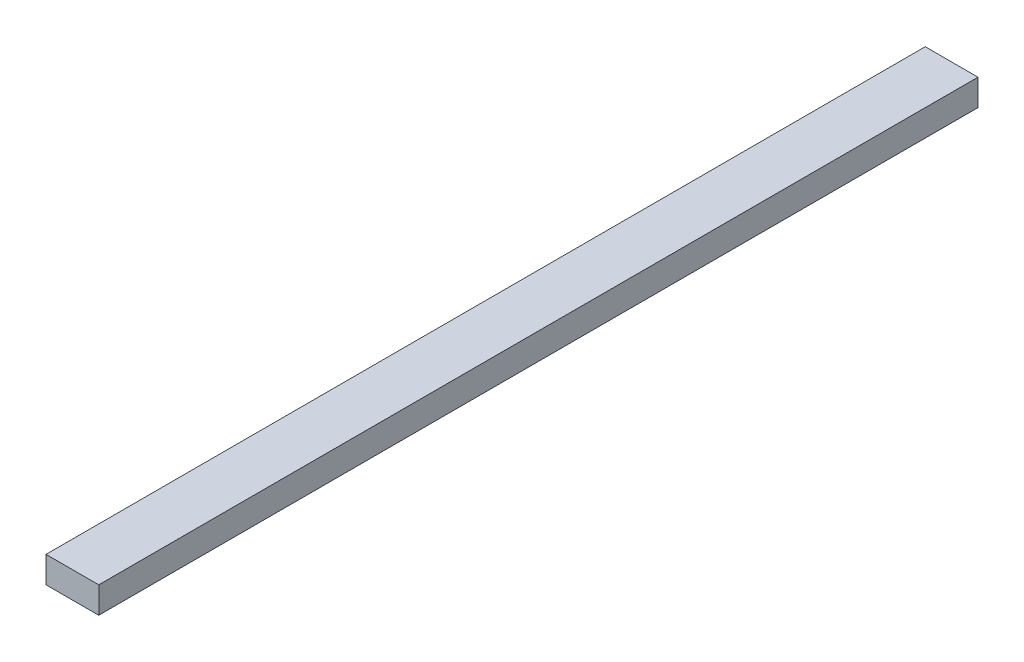
ISO-10303-21;
HEADER;
FILE_DESCRIPTION(('STEP AP214'),'2;1');
FILE_NAME('part.step','',(''),(''),'','','');
FILE_SCHEMA(('AUTOMOTIVE_DESIGN { 1 0 10303 214 1 1 1 1 }'));
ENDSEC;
DATA;
#1=APPLICATION_CONTEXT('core data for automotive mechanical design processes');
#2=APPLICATION_PROTOCOL_DEFINITION('international standard','automotive_design',2000,#1);
#3=PRODUCT_CONTEXT('',#1,'mechanical');
#4=PRODUCT('Part','Part','',(#3));
#5=PRODUCT_RELATED_PRODUCT_CATEGORY('part','',(#4));
#6=PRODUCT_DEFINITION_FORMATION('','',#4);
#7=PRODUCT_DEFINITION_CONTEXT('part definition',#1,'design');
#8=PRODUCT_DEFINITION('design','',#6,#7);
#9=PRODUCT_DEFINITION_SHAPE('','',#8);
#10=(LENGTH_UNIT() NAMED_UNIT(*) SI_UNIT(.MILLI.,.METRE.));
#11=(NAMED_UNIT(*) PLANE_ANGLE_UNIT() SI_UNIT($,.RADIAN.));
#12=(NAMED_UNIT(*) SI_UNIT($,.STERADIAN.) SOLID_ANGLE_UNIT());
#13=UNCERTAINTY_MEASURE_WITH_UNIT(LENGTH_MEASURE(1.E-05),#10,'distance_accuracy_value','');
#14=(GEOMETRIC_REPRESENTATION_CONTEXT(3) GLOBAL_UNCERTAINTY_ASSIGNED_CONTEXT((#13)) GLOBAL_UNIT_ASSIGNED_CONTEXT((#10,
#11,#12)) REPRESENTATION_CONTEXT('',''));
#15=CARTESIAN_POINT('',(0.,0.,0.));
#16=DIRECTION('',(0.,0.,1.));
#17=DIRECTION('',(1.,0.,0.));
#18=AXIS2_PLACEMENT_3D('',#15,#16,#17);
#19=CARTESIAN_POINT('',(-9.48424737456244,-4.64594099016502,500.));
#20=DIRECTION('',(1.,0.,0.));
#21=DIRECTION('',(0.,1.,0.));
#22=AXIS2_PLACEMENT_3D('',#19,#20,#21);
#23=PLANE('',#22);
#24=DIRECTION('',(0.,-1.,0.));
#25=VECTOR('',#24,1.);
#26=CARTESIAN_POINT('',(-9.48424737456244,-4.64594099016502,0.));
#27=LINE('',#26,#25);
#28=CARTESIAN_POINT('',(-9.48424737456244,-4.64594099016502,0.));
#29=VERTEX_POINT('',#28);
#30=CARTESIAN_POINT('',(-9.48424737456244,-19.645940990165,0.));
#31=VERTEX_POINT('',#30);
#32=EDGE_CURVE('E107',#29,#31,#27,.T.);
#33=ORIENTED_EDGE('',*,*,#32,.T.);
#34=DIRECTION('',(0.,0.,-1.));
#35=VECTOR('',#34,1.);
#36=CARTESIAN_POINT('',(-9.48424737456244,-19.645940990165,500.));
#37=LINE('',#36,#35);
#38=CARTESIAN_POINT('',(-9.48424737456244,-19.645940990165,500.));
#39=VERTEX_POINT('',#38);
#40=EDGE_CURVE('E11',#39,#31,#37,.T.);
#41=ORIENTED_EDGE('',*,*,#40,.F.);
#42=DIRECTION('',(0.,-1.,0.));
#43=VECTOR('',#42,1.);
#44=CARTESIAN_POINT('',(-9.48424737456244,-4.64594099016502,500.));
#45=LINE('',#44,#43);
#46=CARTESIAN_POINT('',(-9.48424737456244,-4.64594099016502,500.));
#47=VERTEX_POINT('',#46);
#48=EDGE_CURVE('E91',#47,#39,#45,.T.);
#49=ORIENTED_EDGE('',*,*,#48,.F.);
#50=DIRECTION('',(0.,0.,-1.));
#51=VECTOR('',#50,1.);
#52=CARTESIAN_POINT('',(-9.48424737456244,-4.64594099016502,500.));
#53=LINE('',#52,#51);
#54=EDGE_CURVE('E103',#47,#29,#53,.T.);
#55=ORIENTED_EDGE('',*,*,#54,.T.);
#56=EDGE_LOOP('',(#33,#41,#49,#55));
#57=FACE_BOUND('',#56,.T.);
#58=ADVANCED_FACE('F39',(#57),#23,.F.);
#59=CARTESIAN_POINT('',(-9.48424737456244,-19.645940990165,500.));
#60=DIRECTION('',(0.,1.,0.));
#61=DIRECTION('',(0.,0.,1.));
#62=AXIS2_PLACEMENT_3D('',#59,#60,#61);
#63=PLANE('',#62);
#64=DIRECTION('',(1.,0.,0.));
#65=VECTOR('',#64,1.);
#66=CARTESIAN_POINT('',(-9.48424737456244,-19.645940990165,0.));
#67=LINE('',#66,#65);
#68=CARTESIAN_POINT('',(20.5157526254376,-19.645940990165,0.));
#69=VERTEX_POINT('',#68);
#70=EDGE_CURVE('E96',#31,#69,#67,.T.);
#71=ORIENTED_EDGE('',*,*,#70,.T.);
#72=DIRECTION('',(0.,0.,-1.));
#73=VECTOR('',#72,1.);
#74=CARTESIAN_POINT('',(20.5157526254376,-19.645940990165,500.));
#75=LINE('',#74,#73);
#76=CARTESIAN_POINT('',(20.5157526254376,-19.645940990165,500.));
#77=VERTEX_POINT('',#76);
#78=EDGE_CURVE('E48',#77,#69,#75,.T.);
#79=ORIENTED_EDGE('',*,*,#78,.F.);
#80=DIRECTION('',(1.,0.,0.));
#81=VECTOR('',#80,1.);
#82=CARTESIAN_POINT('',(-9.48424737456244,-19.645940990165,500.));
#83=LINE('',#82,#81);
#84=EDGE_CURVE('E86',#39,#77,#83,.T.);
#85=ORIENTED_EDGE('',*,*,#84,.F.);
#86=ORIENTED_EDGE('',*,*,#40,.T.);
#87=EDGE_LOOP('',(#71,#79,#85,#86));
#88=FACE_BOUND('',#87,.T.);
#89=ADVANCED_FACE('F95',(#88),#63,.F.);
#90=CARTESIAN_POINT('',(20.5157526254376,-4.64594099016502,500.));
#91=DIRECTION('',(-1.,0.,0.));
#92=DIRECTION('',(0.,0.,1.));
#93=AXIS2_PLACEMENT_3D('',#90,#91,#92);
#94=PLANE('',#93);
#95=DIRECTION('',(0.,1.,0.));
#96=VECTOR('',#95,1.);
#97=CARTESIAN_POINT('',(20.5157526254376,-4.64594099016502,0.));
#98=LINE('',#97,#96);
#99=CARTESIAN_POINT('',(20.5157526254376,-4.64594099016502,0.));
#100=VERTEX_POINT('',#99);
#101=EDGE_CURVE('E73',#69,#100,#98,.T.);
#102=ORIENTED_EDGE('',*,*,#101,.T.);
#103=DIRECTION('',(0.,0.,-1.));
#104=VECTOR('',#103,1.);
#105=CARTESIAN_POINT('',(20.5157526254376,-4.64594099016502,500.));
#106=LINE('',#105,#104);
#107=CARTESIAN_POINT('',(20.5157526254376,-4.64594099016502,500.));
#108=VERTEX_POINT('',#107);
#109=EDGE_CURVE('E98',#108,#100,#106,.T.);
#110=ORIENTED_EDGE('',*,*,#109,.F.);
#111=DIRECTION('',(0.,1.,0.));
#112=VECTOR('',#111,1.);
#113=CARTESIAN_POINT('',(20.5157526254376,-4.64594099016502,500.));
#114=LINE('',#113,#112);
#115=EDGE_CURVE('E89',#77,#108,#114,.T.);
#116=ORIENTED_EDGE('',*,*,#115,.F.);
#117=ORIENTED_EDGE('',*,*,#78,.T.);
#118=EDGE_LOOP('',(#102,#110,#116,#117));
#119=FACE_BOUND('',#118,.T.);
#120=ADVANCED_FACE('F99',(#119),#94,.F.);
#121=CARTESIAN_POINT('',(-9.48424737456244,-4.64594099016502,500.));
#122=DIRECTION('',(0.,-1.,0.));
#123=DIRECTION('',(0.,0.,-1.));
#124=AXIS2_PLACEMENT_3D('',#121,#122,#123);
#125=PLANE('',#124);
#126=DIRECTION('',(-1.,0.,0.));
#127=VECTOR('',#126,1.);
#128=CARTESIAN_POINT('',(-9.48424737456244,-4.64594099016502,0.));
#129=LINE('',#128,#127);
#130=EDGE_CURVE('E79',#100,#29,#129,.T.);
#131=ORIENTED_EDGE('',*,*,#130,.T.);
#132=ORIENTED_EDGE('',*,*,#54,.F.);
#133=DIRECTION('',(-1.,0.,0.));
#134=VECTOR('',#133,1.);
#135=CARTESIAN_POINT('',(-9.48424737456244,-4.64594099016502,500.));
#136=LINE('',#135,#134);
#137=EDGE_CURVE('E56',#108,#47,#136,.T.);
#138=ORIENTED_EDGE('',*,*,#137,.F.);
#139=ORIENTED_EDGE('',*,*,#109,.T.);
#140=EDGE_LOOP('',(#131,#132,#138,#139));
#141=FACE_BOUND('',#140,.T.);
#142=ADVANCED_FACE('F120',(#141),#125,.F.);
#143=CARTESIAN_POINT('',(0.,0.,500.));
#144=DIRECTION('',(0.,0.,1.));
#145=DIRECTION('',(1.,0.,0.));
#146=AXIS2_PLACEMENT_3D('',#143,#144,#145);
#147=PLANE('',#146);
#148=ORIENTED_EDGE('',*,*,#48,.T.);
#149=ORIENTED_EDGE('',*,*,#84,.T.);
#150=ORIENTED_EDGE('',*,*,#115,.T.);
#151=ORIENTED_EDGE('',*,*,#137,.T.);
#152=EDGE_LOOP('',(#148,#149,#150,#151));
#153=FACE_BOUND('',#152,.T.);
#154=ADVANCED_FACE('F87',(#153),#147,.T.);
#155=CARTESIAN_POINT('',(0.,0.,0.));
#156=DIRECTION('',(0.,0.,1.));
#157=DIRECTION('',(1.,0.,0.));
#158=AXIS2_PLACEMENT_3D('',#155,#156,#157);
#159=PLANE('',#158);
#160=ORIENTED_EDGE('',*,*,#32,.F.);
#161=ORIENTED_EDGE('',*,*,#130,.F.);
#162=ORIENTED_EDGE('',*,*,#101,.F.);
#163=ORIENTED_EDGE('',*,*,#70,.F.);
#164=EDGE_LOOP('',(#160,#161,#162,#163));
#165=FACE_BOUND('',#164,.T.);
#166=ADVANCED_FACE('F123',(#165),#159,.F.);
#167=CLOSED_SHELL('',(#58,#89,#120,#142,#154,#166));
#168=MANIFOLD_SOLID_BREP('B2',#167);
#169=ADVANCED_BREP_SHAPE_REPRESENTATION('',(#18,#168),#14);
#170=SHAPE_DEFINITION_REPRESENTATION(#9,#169);
ENDSEC;
END-ISO-10303-21;
